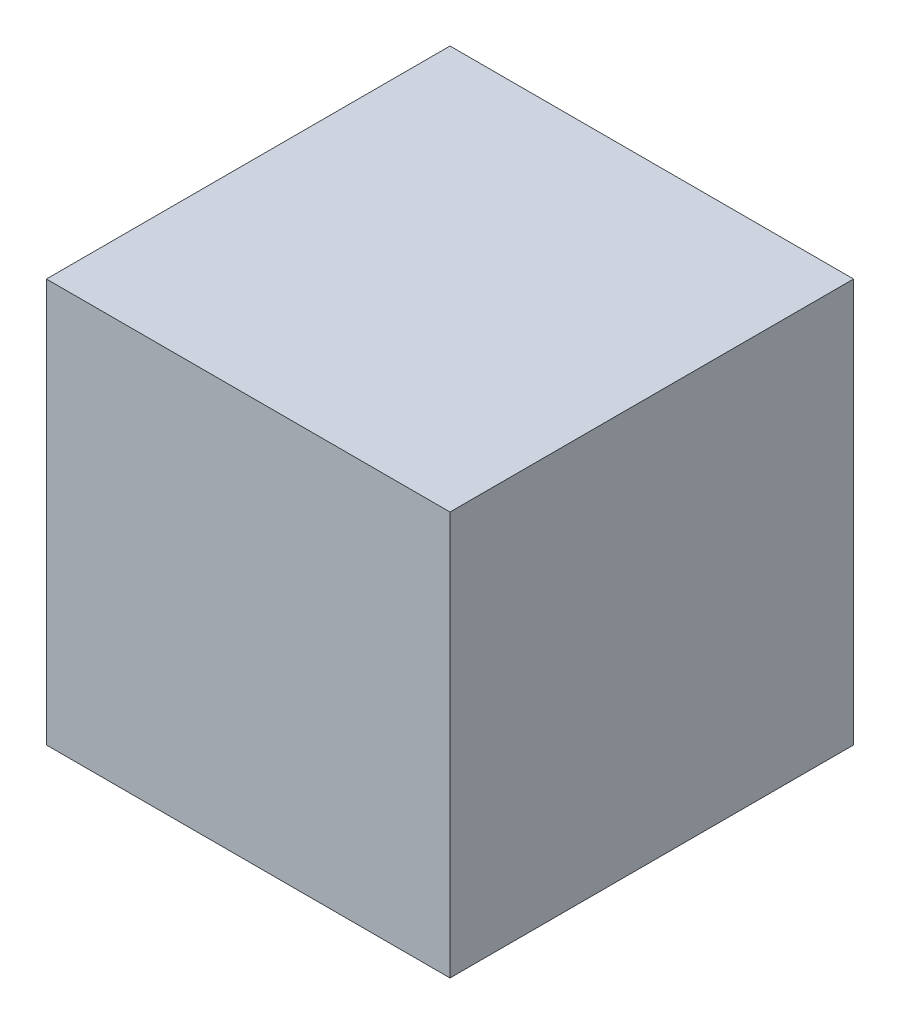
ISO-10303-21;
HEADER;
FILE_DESCRIPTION(('STEP AP214'),'2;1');
FILE_NAME('part.step','',(''),(''),'','','');
FILE_SCHEMA(('AUTOMOTIVE_DESIGN { 1 0 10303 214 1 1 1 1 }'));
ENDSEC;
DATA;
#1=APPLICATION_CONTEXT('core data for automotive mechanical design processes');
#2=APPLICATION_PROTOCOL_DEFINITION('international standard','automotive_design',2000,#1);
#3=PRODUCT_CONTEXT('',#1,'mechanical');
#4=PRODUCT('Part','Part','',(#3));
#5=PRODUCT_RELATED_PRODUCT_CATEGORY('part','',(#4));
#6=PRODUCT_DEFINITION_FORMATION('','',#4);
#7=PRODUCT_DEFINITION_CONTEXT('part definition',#1,'design');
#8=PRODUCT_DEFINITION('design','',#6,#7);
#9=PRODUCT_DEFINITION_SHAPE('','',#8);
#10=(LENGTH_UNIT() NAMED_UNIT(*) SI_UNIT(.MILLI.,.METRE.));
#11=(NAMED_UNIT(*) PLANE_ANGLE_UNIT() SI_UNIT($,.RADIAN.));
#12=(NAMED_UNIT(*) SI_UNIT($,.STERADIAN.) SOLID_ANGLE_UNIT());
#13=UNCERTAINTY_MEASURE_WITH_UNIT(LENGTH_MEASURE(1.E-05),#10,'distance_accuracy_value','');
#14=(GEOMETRIC_REPRESENTATION_CONTEXT(3) GLOBAL_UNCERTAINTY_ASSIGNED_CONTEXT((#13)) GLOBAL_UNIT_ASSIGNED_CONTEXT((#10,
#11,#12)) REPRESENTATION_CONTEXT('',''));
#15=CARTESIAN_POINT('',(0.,0.,0.));
#16=DIRECTION('',(0.,0.,1.));
#17=DIRECTION('',(1.,0.,0.));
#18=AXIS2_PLACEMENT_3D('',#15,#16,#17);
#19=CARTESIAN_POINT('',(0.,19.05,0.));
#20=DIRECTION('',(-1.,0.,0.));
#21=DIRECTION('',(0.,0.,1.));
#22=AXIS2_PLACEMENT_3D('',#19,#20,#21);
#23=PLANE('',#22);
#24=DIRECTION('',(0.,0.,-1.));
#25=VECTOR('',#24,1.);
#26=CARTESIAN_POINT('',(0.,0.,0.));
#27=LINE('',#26,#25);
#28=CARTESIAN_POINT('',(0.,0.,0.));
#29=VERTEX_POINT('',#28);
#30=CARTESIAN_POINT('',(0.,0.,-19.05));
#31=VERTEX_POINT('',#30);
#32=EDGE_CURVE('E95',#29,#31,#27,.T.);
#33=ORIENTED_EDGE('',*,*,#32,.T.);
#34=DIRECTION('',(0.,-1.,0.));
#35=VECTOR('',#34,1.);
#36=CARTESIAN_POINT('',(0.,19.05,-19.05));
#37=LINE('',#36,#35);
#38=CARTESIAN_POINT('',(0.,19.05,-19.05));
#39=VERTEX_POINT('',#38);
#40=EDGE_CURVE('E11',#39,#31,#37,.T.);
#41=ORIENTED_EDGE('',*,*,#40,.F.);
#42=DIRECTION('',(0.,0.,-1.));
#43=VECTOR('',#42,1.);
#44=CARTESIAN_POINT('',(0.,19.05,0.));
#45=LINE('',#44,#43);
#46=CARTESIAN_POINT('',(0.,19.05,0.));
#47=VERTEX_POINT('',#46);
#48=EDGE_CURVE('E83',#47,#39,#45,.T.);
#49=ORIENTED_EDGE('',*,*,#48,.F.);
#50=DIRECTION('',(0.,-1.,0.));
#51=VECTOR('',#50,1.);
#52=CARTESIAN_POINT('',(0.,19.05,0.));
#53=LINE('',#52,#51);
#54=EDGE_CURVE('E91',#47,#29,#53,.T.);
#55=ORIENTED_EDGE('',*,*,#54,.T.);
#56=EDGE_LOOP('',(#33,#41,#49,#55));
#57=FACE_BOUND('',#56,.T.);
#58=ADVANCED_FACE('F32',(#57),#23,.F.);
#59=CARTESIAN_POINT('',(0.,19.05,-19.05));
#60=DIRECTION('',(0.,0.,1.));
#61=DIRECTION('',(1.,0.,0.));
#62=AXIS2_PLACEMENT_3D('',#59,#60,#61);
#63=PLANE('',#62);
#64=DIRECTION('',(-1.,0.,0.));
#65=VECTOR('',#64,1.);
#66=CARTESIAN_POINT('',(0.,0.,-19.05));
#67=LINE('',#66,#65);
#68=CARTESIAN_POINT('',(-19.05,0.,-19.05));
#69=VERTEX_POINT('',#68);
#70=EDGE_CURVE('E87',#31,#69,#67,.T.);
#71=ORIENTED_EDGE('',*,*,#70,.T.);
#72=DIRECTION('',(0.,-1.,0.));
#73=VECTOR('',#72,1.);
#74=CARTESIAN_POINT('',(-19.05,19.05,-19.05));
#75=LINE('',#74,#73);
#76=CARTESIAN_POINT('',(-19.05,19.05,-19.05));
#77=VERTEX_POINT('',#76);
#78=EDGE_CURVE('E40',#77,#69,#75,.T.);
#79=ORIENTED_EDGE('',*,*,#78,.F.);
#80=DIRECTION('',(-1.,0.,0.));
#81=VECTOR('',#80,1.);
#82=CARTESIAN_POINT('',(0.,19.05,-19.05));
#83=LINE('',#82,#81);
#84=EDGE_CURVE('E78',#39,#77,#83,.T.);
#85=ORIENTED_EDGE('',*,*,#84,.F.);
#86=ORIENTED_EDGE('',*,*,#40,.T.);
#87=EDGE_LOOP('',(#71,#79,#85,#86));
#88=FACE_BOUND('',#87,.T.);
#89=ADVANCED_FACE('F86',(#88),#63,.F.);
#90=CARTESIAN_POINT('',(-19.05,19.05,0.));
#91=DIRECTION('',(1.,0.,0.));
#92=DIRECTION('',(0.,0.,-1.));
#93=AXIS2_PLACEMENT_3D('',#90,#91,#92);
#94=PLANE('',#93);
#95=DIRECTION('',(0.,0.,1.));
#96=VECTOR('',#95,1.);
#97=CARTESIAN_POINT('',(-19.05,0.,0.));
#98=LINE('',#97,#96);
#99=CARTESIAN_POINT('',(-19.05,0.,0.));
#100=VERTEX_POINT('',#99);
#101=EDGE_CURVE('E65',#69,#100,#98,.T.);
#102=ORIENTED_EDGE('',*,*,#101,.T.);
#103=DIRECTION('',(0.,-1.,0.));
#104=VECTOR('',#103,1.);
#105=CARTESIAN_POINT('',(-19.05,19.05,0.));
#106=LINE('',#105,#104);
#107=CARTESIAN_POINT('',(-19.05,19.05,0.));
#108=VERTEX_POINT('',#107);
#109=EDGE_CURVE('E88',#108,#100,#106,.T.);
#110=ORIENTED_EDGE('',*,*,#109,.F.);
#111=DIRECTION('',(0.,0.,1.));
#112=VECTOR('',#111,1.);
#113=CARTESIAN_POINT('',(-19.05,19.05,0.));
#114=LINE('',#113,#112);
#115=EDGE_CURVE('E81',#77,#108,#114,.T.);
#116=ORIENTED_EDGE('',*,*,#115,.F.);
#117=ORIENTED_EDGE('',*,*,#78,.T.);
#118=EDGE_LOOP('',(#102,#110,#116,#117));
#119=FACE_BOUND('',#118,.T.);
#120=ADVANCED_FACE('F89',(#119),#94,.F.);
#121=CARTESIAN_POINT('',(0.,19.05,0.));
#122=DIRECTION('',(0.,0.,-1.));
#123=DIRECTION('',(-1.,0.,0.));
#124=AXIS2_PLACEMENT_3D('',#121,#122,#123);
#125=PLANE('',#124);
#126=DIRECTION('',(1.,0.,0.));
#127=VECTOR('',#126,1.);
#128=CARTESIAN_POINT('',(0.,0.,0.));
#129=LINE('',#128,#127);
#130=EDGE_CURVE('E71',#100,#29,#129,.T.);
#131=ORIENTED_EDGE('',*,*,#130,.T.);
#132=ORIENTED_EDGE('',*,*,#54,.F.);
#133=DIRECTION('',(1.,0.,0.));
#134=VECTOR('',#133,1.);
#135=CARTESIAN_POINT('',(0.,19.05,0.));
#136=LINE('',#135,#134);
#137=EDGE_CURVE('E48',#108,#47,#136,.T.);
#138=ORIENTED_EDGE('',*,*,#137,.F.);
#139=ORIENTED_EDGE('',*,*,#109,.T.);
#140=EDGE_LOOP('',(#131,#132,#138,#139));
#141=FACE_BOUND('',#140,.T.);
#142=ADVANCED_FACE('F102',(#141),#125,.F.);
#143=CARTESIAN_POINT('',(0.,19.05,-19.05));
#144=DIRECTION('',(0.,1.,0.));
#145=DIRECTION('',(0.,0.,1.));
#146=AXIS2_PLACEMENT_3D('',#143,#144,#145);
#147=PLANE('',#146);
#148=ORIENTED_EDGE('',*,*,#48,.T.);
#149=ORIENTED_EDGE('',*,*,#84,.T.);
#150=ORIENTED_EDGE('',*,*,#115,.T.);
#151=ORIENTED_EDGE('',*,*,#137,.T.);
#152=EDGE_LOOP('',(#148,#149,#150,#151));
#153=FACE_BOUND('',#152,.T.);
#154=ADVANCED_FACE('F79',(#153),#147,.T.);
#155=CARTESIAN_POINT('',(0.,0.,-19.05));
#156=DIRECTION('',(0.,1.,0.));
#157=DIRECTION('',(0.,0.,1.));
#158=AXIS2_PLACEMENT_3D('',#155,#156,#157);
#159=PLANE('',#158);
#160=ORIENTED_EDGE('',*,*,#32,.F.);
#161=ORIENTED_EDGE('',*,*,#130,.F.);
#162=ORIENTED_EDGE('',*,*,#101,.F.);
#163=ORIENTED_EDGE('',*,*,#70,.F.);
#164=EDGE_LOOP('',(#160,#161,#162,#163));
#165=FACE_BOUND('',#164,.T.);
#166=ADVANCED_FACE('F105',(#165),#159,.F.);
#167=CLOSED_SHELL('',(#58,#89,#120,#142,#154,#166));
#168=MANIFOLD_SOLID_BREP('B2',#167);
#169=ADVANCED_BREP_SHAPE_REPRESENTATION('',(#18,#168),#14);
#170=SHAPE_DEFINITION_REPRESENTATION(#9,#169);
ENDSEC;
END-ISO-10303-21;
